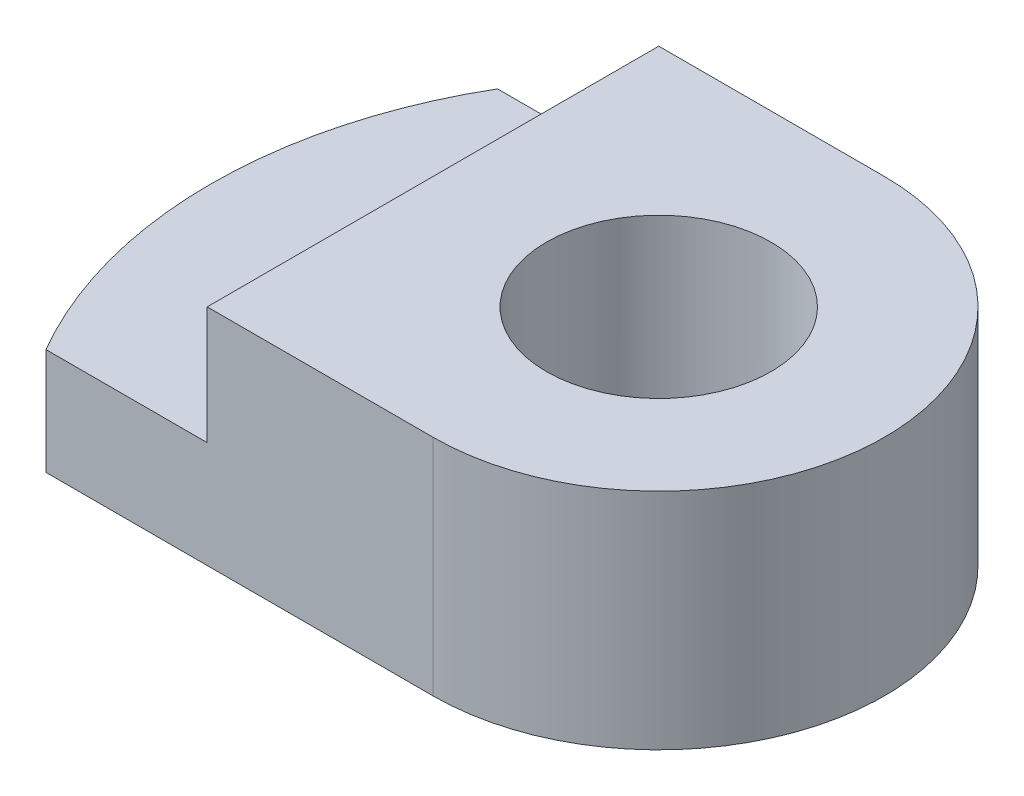
ISO-10303-21;
HEADER;
FILE_DESCRIPTION(('STEP AP214'),'2;1');
FILE_NAME('part.step','',(''),(''),'','','');
FILE_SCHEMA(('AUTOMOTIVE_DESIGN { 1 0 10303 214 1 1 1 1 }'));
ENDSEC;
DATA;
#1=APPLICATION_CONTEXT('core data for automotive mechanical design processes');
#2=APPLICATION_PROTOCOL_DEFINITION('international standard','automotive_design',2000,#1);
#3=PRODUCT_CONTEXT('',#1,'mechanical');
#4=PRODUCT('Part','Part','',(#3));
#5=PRODUCT_RELATED_PRODUCT_CATEGORY('part','',(#4));
#6=PRODUCT_DEFINITION_FORMATION('','',#4);
#7=PRODUCT_DEFINITION_CONTEXT('part definition',#1,'design');
#8=PRODUCT_DEFINITION('design','',#6,#7);
#9=PRODUCT_DEFINITION_SHAPE('','',#8);
#10=(LENGTH_UNIT() NAMED_UNIT(*) SI_UNIT(.MILLI.,.METRE.));
#11=(NAMED_UNIT(*) PLANE_ANGLE_UNIT() SI_UNIT($,.RADIAN.));
#12=(NAMED_UNIT(*) SI_UNIT($,.STERADIAN.) SOLID_ANGLE_UNIT());
#13=UNCERTAINTY_MEASURE_WITH_UNIT(LENGTH_MEASURE(1.E-05),#10,'distance_accuracy_value','');
#14=(GEOMETRIC_REPRESENTATION_CONTEXT(3) GLOBAL_UNCERTAINTY_ASSIGNED_CONTEXT((#13)) GLOBAL_UNIT_ASSIGNED_CONTEXT((#10,
#11,#12)) REPRESENTATION_CONTEXT('',''));
#15=CARTESIAN_POINT('',(0.,0.,0.));
#16=DIRECTION('',(0.,0.,1.));
#17=DIRECTION('',(1.,0.,0.));
#18=AXIS2_PLACEMENT_3D('',#15,#16,#17);
#19=CARTESIAN_POINT('',(0.,38.1,0.));
#20=DIRECTION('',(0.,-1.,0.));
#21=DIRECTION('',(0.,0.,-1.));
#22=AXIS2_PLACEMENT_3D('',#19,#20,#21);
#23=CYLINDRICAL_SURFACE('',#22,38.1);
#24=CARTESIAN_POINT('',(0.,28.1,0.));
#25=DIRECTION('',(0.,1.,0.));
#26=DIRECTION('',(0.,0.,1.));
#27=AXIS2_PLACEMENT_3D('',#24,#25,#26);
#28=CIRCLE('',#27,38.1);
#29=CARTESIAN_POINT('',(-32.908509537808,28.1,-19.2));
#30=VERTEX_POINT('',#29);
#31=CARTESIAN_POINT('',(-32.908509537808,28.1,19.2));
#32=VERTEX_POINT('',#31);
#33=EDGE_CURVE('E49',#30,#32,#28,.T.);
#34=ORIENTED_EDGE('',*,*,#33,.F.);
#35=DIRECTION('',(0.,1.,0.));
#36=VECTOR('',#35,1.);
#37=CARTESIAN_POINT('',(-32.908509537808,-3.81000000000002,-19.2));
#38=LINE('',#37,#36);
#39=CARTESIAN_POINT('',(-32.908509537808,19.05,-19.2));
#40=VERTEX_POINT('',#39);
#41=EDGE_CURVE('E99',#40,#30,#38,.T.);
#42=ORIENTED_EDGE('',*,*,#41,.F.);
#43=CARTESIAN_POINT('',(0.,19.05,0.));
#44=DIRECTION('',(0.,1.,0.));
#45=DIRECTION('',(0.,0.,1.));
#46=AXIS2_PLACEMENT_3D('',#43,#44,#45);
#47=CIRCLE('',#46,38.1);
#48=CARTESIAN_POINT('',(-32.908509537808,19.05,19.2));
#49=VERTEX_POINT('',#48);
#50=EDGE_CURVE('E223',#40,#49,#47,.T.);
#51=ORIENTED_EDGE('',*,*,#50,.T.);
#52=DIRECTION('',(0.,1.,0.));
#53=VECTOR('',#52,1.);
#54=CARTESIAN_POINT('',(-32.908509537808,-3.81000000000002,19.2));
#55=LINE('',#54,#53);
#56=EDGE_CURVE('E101',#49,#32,#55,.T.);
#57=ORIENTED_EDGE('',*,*,#56,.T.);
#58=EDGE_LOOP('',(#34,#42,#51,#57));
#59=FACE_BOUND('',#58,.T.);
#60=ADVANCED_FACE('F35',(#59),#23,.T.);
#61=CARTESIAN_POINT('',(0.,38.1,0.));
#62=DIRECTION('',(0.,1.,0.));
#63=DIRECTION('',(0.,0.,1.));
#64=AXIS2_PLACEMENT_3D('',#61,#62,#63);
#65=PLANE('',#64);
#66=DIRECTION('',(0.,0.,-1.));
#67=VECTOR('',#66,1.);
#68=CARTESIAN_POINT('',(-19.2,38.1,-19.2));
#69=LINE('',#68,#67);
#70=CARTESIAN_POINT('',(-19.2,38.1,19.2));
#71=VERTEX_POINT('',#70);
#72=CARTESIAN_POINT('',(-19.2,38.1,-19.2));
#73=VERTEX_POINT('',#72);
#74=EDGE_CURVE('E93',#71,#73,#69,.T.);
#75=ORIENTED_EDGE('',*,*,#74,.F.);
#76=DIRECTION('',(1.,0.,0.));
#77=VECTOR('',#76,1.);
#78=CARTESIAN_POINT('',(0.,38.1,19.2));
#79=LINE('',#78,#77);
#80=CARTESIAN_POINT('',(0.,38.1,19.2));
#81=VERTEX_POINT('',#80);
#82=EDGE_CURVE('E109',#71,#81,#79,.T.);
#83=ORIENTED_EDGE('',*,*,#82,.T.);
#84=CARTESIAN_POINT('',(0.,38.1,0.));
#85=DIRECTION('',(0.,1.,0.));
#86=DIRECTION('',(0.,0.,1.));
#87=AXIS2_PLACEMENT_3D('',#84,#85,#86);
#88=CIRCLE('',#87,19.2);
#89=CARTESIAN_POINT('',(0.,38.1,-19.2));
#90=VERTEX_POINT('',#89);
#91=EDGE_CURVE('E119',#81,#90,#88,.T.);
#92=ORIENTED_EDGE('',*,*,#91,.T.);
#93=DIRECTION('',(-1.,0.,0.));
#94=VECTOR('',#93,1.);
#95=CARTESIAN_POINT('',(0.,38.1,-19.2));
#96=LINE('',#95,#94);
#97=EDGE_CURVE('E57',#90,#73,#96,.T.);
#98=ORIENTED_EDGE('',*,*,#97,.T.);
#99=EDGE_LOOP('',(#75,#83,#92,#98));
#100=FACE_BOUND('',#99,.T.);
#101=CARTESIAN_POINT('',(0.,38.1,0.));
#102=DIRECTION('',(0.,1.,0.));
#103=DIRECTION('',(0.,0.,1.));
#104=AXIS2_PLACEMENT_3D('',#101,#102,#103);
#105=CIRCLE('',#104,9.54666602784106);
#106=CARTESIAN_POINT('',(0.,38.1,9.54666602784106));
#107=VERTEX_POINT('',#106);
#108=EDGE_CURVE('E42',#107,#107,#105,.T.);
#109=ORIENTED_EDGE('',*,*,#108,.F.);
#110=EDGE_LOOP('',(#109));
#111=FACE_BOUND('',#110,.T.);
#112=ADVANCED_FACE('F127',(#100,#111),#65,.T.);
#113=CARTESIAN_POINT('',(38.1,19.05,-106.68));
#114=DIRECTION('',(0.,1.,0.));
#115=DIRECTION('',(-1.,0.,0.));
#116=AXIS2_PLACEMENT_3D('',#113,#114,#115);
#117=PLANE('',#116);
#118=CARTESIAN_POINT('',(0.,19.05,0.));
#119=DIRECTION('',(0.,1.,0.));
#120=DIRECTION('',(-1.,0.,0.));
#121=AXIS2_PLACEMENT_3D('',#118,#119,#120);
#122=CIRCLE('',#121,9.54666602784106);
#123=CARTESIAN_POINT('',(-9.54666602784106,19.05,0.));
#124=VERTEX_POINT('',#123);
#125=EDGE_CURVE('E11',#124,#124,#122,.T.);
#126=ORIENTED_EDGE('',*,*,#125,.T.);
#127=EDGE_LOOP('',(#126));
#128=FACE_BOUND('',#127,.T.);
#129=CARTESIAN_POINT('',(0.,19.05,0.));
#130=DIRECTION('',(0.,1.,0.));
#131=DIRECTION('',(-1.,0.,0.));
#132=AXIS2_PLACEMENT_3D('',#129,#130,#131);
#133=CIRCLE('',#132,19.2);
#134=CARTESIAN_POINT('',(0.,19.05,19.2));
#135=VERTEX_POINT('',#134);
#136=CARTESIAN_POINT('',(0.,19.05,-19.2));
#137=VERTEX_POINT('',#136);
#138=EDGE_CURVE('E116',#135,#137,#133,.T.);
#139=ORIENTED_EDGE('',*,*,#138,.F.);
#140=DIRECTION('',(-1.,0.,0.));
#141=VECTOR('',#140,1.);
#142=CARTESIAN_POINT('',(0.,19.05,19.2));
#143=LINE('',#142,#141);
#144=EDGE_CURVE('E217',#135,#49,#143,.T.);
#145=ORIENTED_EDGE('',*,*,#144,.T.);
#146=ORIENTED_EDGE('',*,*,#50,.F.);
#147=DIRECTION('',(1.,0.,0.));
#148=VECTOR('',#147,1.);
#149=CARTESIAN_POINT('',(0.,19.05,-19.2));
#150=LINE('',#149,#148);
#151=EDGE_CURVE('E106',#40,#137,#150,.T.);
#152=ORIENTED_EDGE('',*,*,#151,.T.);
#153=EDGE_LOOP('',(#139,#145,#146,#152));
#154=FACE_BOUND('',#153,.T.);
#155=ADVANCED_FACE('F129',(#128,#154),#117,.F.);
#156=CARTESIAN_POINT('',(0.,38.1,0.));
#157=DIRECTION('',(0.,-1.,0.));
#158=DIRECTION('',(0.,0.,-1.));
#159=AXIS2_PLACEMENT_3D('',#156,#157,#158);
#160=CYLINDRICAL_SURFACE('',#159,9.54666602784106);
#161=ORIENTED_EDGE('',*,*,#125,.F.);
#162=EDGE_LOOP('',(#161));
#163=FACE_BOUND('',#162,.T.);
#164=ORIENTED_EDGE('',*,*,#108,.T.);
#165=EDGE_LOOP('',(#164));
#166=FACE_BOUND('',#165,.T.);
#167=ADVANCED_FACE('F125',(#163,#166),#160,.F.);
#168=CARTESIAN_POINT('',(0.,-3.81000000000001,-19.2));
#169=DIRECTION('',(0.,0.,-1.));
#170=DIRECTION('',(-1.,0.,0.));
#171=AXIS2_PLACEMENT_3D('',#168,#169,#170);
#172=PLANE('',#171);
#173=DIRECTION('',(0.,1.,0.));
#174=VECTOR('',#173,1.);
#175=CARTESIAN_POINT('',(-19.2,28.1,-19.2));
#176=LINE('',#175,#174);
#177=CARTESIAN_POINT('',(-19.2,28.1,-19.2));
#178=VERTEX_POINT('',#177);
#179=EDGE_CURVE('E212',#178,#73,#176,.T.);
#180=ORIENTED_EDGE('',*,*,#179,.T.);
#181=ORIENTED_EDGE('',*,*,#97,.F.);
#182=DIRECTION('',(0.,1.,0.));
#183=VECTOR('',#182,1.);
#184=CARTESIAN_POINT('',(0.,-3.81000000000001,-19.2));
#185=LINE('',#184,#183);
#186=EDGE_CURVE('E107',#137,#90,#185,.T.);
#187=ORIENTED_EDGE('',*,*,#186,.F.);
#188=ORIENTED_EDGE('',*,*,#151,.F.);
#189=ORIENTED_EDGE('',*,*,#41,.T.);
#190=DIRECTION('',(-1.,0.,0.));
#191=VECTOR('',#190,1.);
#192=CARTESIAN_POINT('',(-19.2,28.1,-19.2));
#193=LINE('',#192,#191);
#194=EDGE_CURVE('E88',#178,#30,#193,.T.);
#195=ORIENTED_EDGE('',*,*,#194,.F.);
#196=EDGE_LOOP('',(#180,#181,#187,#188,#189,#195));
#197=FACE_BOUND('',#196,.T.);
#198=ADVANCED_FACE('F105',(#197),#172,.T.);
#199=CARTESIAN_POINT('',(0.,-3.81000000000001,0.));
#200=DIRECTION('',(0.,1.,0.));
#201=DIRECTION('',(0.,0.,1.));
#202=AXIS2_PLACEMENT_3D('',#199,#200,#201);
#203=CYLINDRICAL_SURFACE('',#202,19.2);
#204=DIRECTION('',(0.,1.,0.));
#205=VECTOR('',#204,1.);
#206=CARTESIAN_POINT('',(0.,-3.81000000000001,19.2));
#207=LINE('',#206,#205);
#208=EDGE_CURVE('E111',#135,#81,#207,.T.);
#209=ORIENTED_EDGE('',*,*,#208,.F.);
#210=ORIENTED_EDGE('',*,*,#138,.T.);
#211=ORIENTED_EDGE('',*,*,#186,.T.);
#212=ORIENTED_EDGE('',*,*,#91,.F.);
#213=EDGE_LOOP('',(#209,#210,#211,#212));
#214=FACE_BOUND('',#213,.T.);
#215=ADVANCED_FACE('F142',(#214),#203,.T.);
#216=CARTESIAN_POINT('',(0.,-3.81000000000001,19.2));
#217=DIRECTION('',(0.,0.,1.));
#218=DIRECTION('',(1.,0.,0.));
#219=AXIS2_PLACEMENT_3D('',#216,#217,#218);
#220=PLANE('',#219);
#221=DIRECTION('',(0.,1.,0.));
#222=VECTOR('',#221,1.);
#223=CARTESIAN_POINT('',(-19.2,28.1,19.2));
#224=LINE('',#223,#222);
#225=CARTESIAN_POINT('',(-19.2,28.1,19.2));
#226=VERTEX_POINT('',#225);
#227=EDGE_CURVE('E214',#226,#71,#224,.T.);
#228=ORIENTED_EDGE('',*,*,#227,.F.);
#229=DIRECTION('',(1.,0.,0.));
#230=VECTOR('',#229,1.);
#231=CARTESIAN_POINT('',(-19.2,28.1,19.2));
#232=LINE('',#231,#230);
#233=EDGE_CURVE('E102',#32,#226,#232,.T.);
#234=ORIENTED_EDGE('',*,*,#233,.F.);
#235=ORIENTED_EDGE('',*,*,#56,.F.);
#236=ORIENTED_EDGE('',*,*,#144,.F.);
#237=ORIENTED_EDGE('',*,*,#208,.T.);
#238=ORIENTED_EDGE('',*,*,#82,.F.);
#239=EDGE_LOOP('',(#228,#234,#235,#236,#237,#238));
#240=FACE_BOUND('',#239,.T.);
#241=ADVANCED_FACE('F145',(#240),#220,.T.);
#242=CARTESIAN_POINT('',(-19.2,28.1,-19.2));
#243=DIRECTION('',(1.,0.,0.));
#244=DIRECTION('',(0.,0.,-1.));
#245=AXIS2_PLACEMENT_3D('',#242,#243,#244);
#246=PLANE('',#245);
#247=ORIENTED_EDGE('',*,*,#74,.T.);
#248=ORIENTED_EDGE('',*,*,#179,.F.);
#249=DIRECTION('',(0.,0.,-1.));
#250=VECTOR('',#249,1.);
#251=CARTESIAN_POINT('',(-19.2,28.1,-19.2));
#252=LINE('',#251,#250);
#253=EDGE_CURVE('E91',#226,#178,#252,.T.);
#254=ORIENTED_EDGE('',*,*,#253,.F.);
#255=ORIENTED_EDGE('',*,*,#227,.T.);
#256=EDGE_LOOP('',(#247,#248,#254,#255));
#257=FACE_BOUND('',#256,.T.);
#258=ADVANCED_FACE('F151',(#257),#246,.F.);
#259=CARTESIAN_POINT('',(0.,28.1,0.));
#260=DIRECTION('',(0.,1.,0.));
#261=DIRECTION('',(0.,0.,1.));
#262=AXIS2_PLACEMENT_3D('',#259,#260,#261);
#263=PLANE('',#262);
#264=ORIENTED_EDGE('',*,*,#194,.T.);
#265=ORIENTED_EDGE('',*,*,#33,.T.);
#266=ORIENTED_EDGE('',*,*,#233,.T.);
#267=ORIENTED_EDGE('',*,*,#253,.T.);
#268=EDGE_LOOP('',(#264,#265,#266,#267));
#269=FACE_BOUND('',#268,.T.);
#270=ADVANCED_FACE('F89',(#269),#263,.T.);
#271=CLOSED_SHELL('',(#60,#112,#155,#167,#198,#215,#241,#258,#270));
#272=MANIFOLD_SOLID_BREP('B2',#271);
#273=ADVANCED_BREP_SHAPE_REPRESENTATION('',(#18,#272),#14);
#274=SHAPE_DEFINITION_REPRESENTATION(#9,#273);
ENDSEC;
END-ISO-10303-21;
